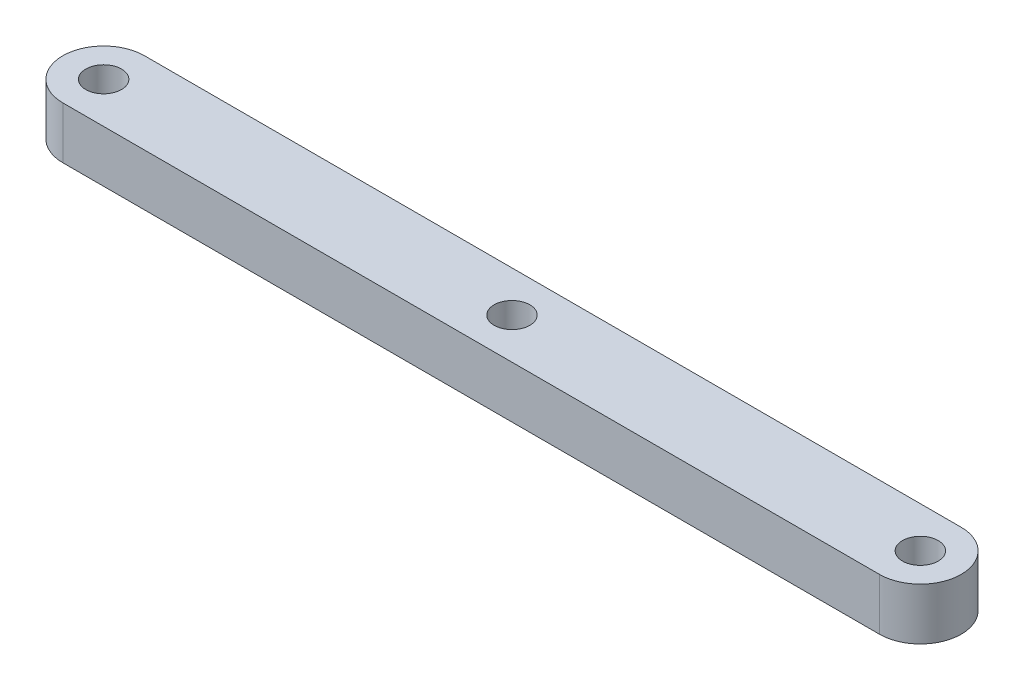
ISO-10303-21;
HEADER;
FILE_DESCRIPTION(('STEP AP214'),'2;1');
FILE_NAME('part.step','',(''),(''),'','','');
FILE_SCHEMA(('AUTOMOTIVE_DESIGN { 1 0 10303 214 1 1 1 1 }'));
ENDSEC;
DATA;
#1=APPLICATION_CONTEXT('core data for automotive mechanical design processes');
#2=APPLICATION_PROTOCOL_DEFINITION('international standard','automotive_design',2000,#1);
#3=PRODUCT_CONTEXT('',#1,'mechanical');
#4=PRODUCT('Part','Part','',(#3));
#5=PRODUCT_RELATED_PRODUCT_CATEGORY('part','',(#4));
#6=PRODUCT_DEFINITION_FORMATION('','',#4);
#7=PRODUCT_DEFINITION_CONTEXT('part definition',#1,'design');
#8=PRODUCT_DEFINITION('design','',#6,#7);
#9=PRODUCT_DEFINITION_SHAPE('','',#8);
#10=(LENGTH_UNIT() NAMED_UNIT(*) SI_UNIT(.MILLI.,.METRE.));
#11=(NAMED_UNIT(*) PLANE_ANGLE_UNIT() SI_UNIT($,.RADIAN.));
#12=(NAMED_UNIT(*) SI_UNIT($,.STERADIAN.) SOLID_ANGLE_UNIT());
#13=UNCERTAINTY_MEASURE_WITH_UNIT(LENGTH_MEASURE(1.E-05),#10,'distance_accuracy_value','');
#14=(GEOMETRIC_REPRESENTATION_CONTEXT(3) GLOBAL_UNCERTAINTY_ASSIGNED_CONTEXT((#13)) GLOBAL_UNIT_ASSIGNED_CONTEXT((#10,
#11,#12)) REPRESENTATION_CONTEXT('',''));
#15=CARTESIAN_POINT('',(0.,0.,0.));
#16=DIRECTION('',(0.,0.,1.));
#17=DIRECTION('',(1.,0.,0.));
#18=AXIS2_PLACEMENT_3D('',#15,#16,#17);
#19=CARTESIAN_POINT('',(-10.0217864923747,3.175,-4.02414143726367));
#20=DIRECTION('',(0.,1.,0.));
#21=DIRECTION('',(0.,0.,1.));
#22=AXIS2_PLACEMENT_3D('',#19,#20,#21);
#23=PLANE('',#22);
#24=CARTESIAN_POINT('',(39.9782135076253,3.175,-4.02414143726367));
#25=DIRECTION('',(0.,1.,0.));
#26=DIRECTION('',(0.,0.,1.));
#27=AXIS2_PLACEMENT_3D('',#24,#25,#26);
#28=CIRCLE('',#27,1.0922);
#29=CARTESIAN_POINT('',(39.9782135076253,3.175,-2.93194143726367));
#30=VERTEX_POINT('',#29);
#31=EDGE_CURVE('E115',#30,#30,#28,.T.);
#32=ORIENTED_EDGE('',*,*,#31,.F.);
#33=EDGE_LOOP('',(#32));
#34=FACE_BOUND('',#33,.T.);
#35=CARTESIAN_POINT('',(-10.0217864923747,3.175,-4.02414143726367));
#36=DIRECTION('',(0.,1.,0.));
#37=DIRECTION('',(0.,0.,1.));
#38=AXIS2_PLACEMENT_3D('',#35,#36,#37);
#39=CIRCLE('',#38,2.5);
#40=CARTESIAN_POINT('',(-10.0217864923747,3.175,-6.52414143726367));
#41=VERTEX_POINT('',#40);
#42=CARTESIAN_POINT('',(-10.0217864923747,3.175,-1.52414143726367));
#43=VERTEX_POINT('',#42);
#44=EDGE_CURVE('E85',#41,#43,#39,.T.);
#45=ORIENTED_EDGE('',*,*,#44,.T.);
#46=DIRECTION('',(1.,0.,0.));
#47=VECTOR('',#46,1.);
#48=CARTESIAN_POINT('',(-10.0217864923747,3.175,-1.52414143726367));
#49=LINE('',#48,#47);
#50=CARTESIAN_POINT('',(39.9782135076253,3.175,-1.52414143726367));
#51=VERTEX_POINT('',#50);
#52=EDGE_CURVE('E80',#43,#51,#49,.T.);
#53=ORIENTED_EDGE('',*,*,#52,.T.);
#54=CARTESIAN_POINT('',(39.9782135076253,3.175,-4.02414143726367));
#55=DIRECTION('',(0.,1.,0.));
#56=DIRECTION('',(0.,0.,1.));
#57=AXIS2_PLACEMENT_3D('',#54,#55,#56);
#58=CIRCLE('',#57,2.5);
#59=CARTESIAN_POINT('',(39.9782135076253,3.175,-6.52414143726367));
#60=VERTEX_POINT('',#59);
#61=EDGE_CURVE('E83',#51,#60,#58,.T.);
#62=ORIENTED_EDGE('',*,*,#61,.T.);
#63=DIRECTION('',(-1.,0.,0.));
#64=VECTOR('',#63,1.);
#65=CARTESIAN_POINT('',(-10.0217864923747,3.175,-6.52414143726367));
#66=LINE('',#65,#64);
#67=EDGE_CURVE('E50',#60,#41,#66,.T.);
#68=ORIENTED_EDGE('',*,*,#67,.T.);
#69=EDGE_LOOP('',(#45,#53,#62,#68));
#70=FACE_BOUND('',#69,.T.);
#71=CARTESIAN_POINT('',(-10.0217864923747,3.175,-4.02414143726367));
#72=DIRECTION('',(0.,1.,0.));
#73=DIRECTION('',(0.,0.,1.));
#74=AXIS2_PLACEMENT_3D('',#71,#72,#73);
#75=CIRCLE('',#74,1.0922);
#76=CARTESIAN_POINT('',(-10.0217864923747,3.175,-2.93194143726367));
#77=VERTEX_POINT('',#76);
#78=EDGE_CURVE('E100',#77,#77,#75,.T.);
#79=ORIENTED_EDGE('',*,*,#78,.F.);
#80=EDGE_LOOP('',(#79));
#81=FACE_BOUND('',#80,.T.);
#82=CARTESIAN_POINT('',(14.9782135076253,3.175,-4.02414143726367));
#83=DIRECTION('',(0.,1.,0.));
#84=DIRECTION('',(0.,0.,1.));
#85=AXIS2_PLACEMENT_3D('',#82,#83,#84);
#86=CIRCLE('',#85,1.0922);
#87=CARTESIAN_POINT('',(14.9782135076253,3.175,-2.93194143726367));
#88=VERTEX_POINT('',#87);
#89=EDGE_CURVE('E121',#88,#88,#86,.T.);
#90=ORIENTED_EDGE('',*,*,#89,.F.);
#91=EDGE_LOOP('',(#90));
#92=FACE_BOUND('',#91,.T.);
#93=ADVANCED_FACE('F33',(#34,#70,#81,#92),#23,.T.);
#94=CARTESIAN_POINT('',(-10.0217864923747,0.,-4.02414143726367));
#95=DIRECTION('',(0.,1.,0.));
#96=DIRECTION('',(0.,0.,1.));
#97=AXIS2_PLACEMENT_3D('',#94,#95,#96);
#98=PLANE('',#97);
#99=CARTESIAN_POINT('',(39.9782135076253,0.,-4.02414143726367));
#100=DIRECTION('',(0.,1.,0.));
#101=DIRECTION('',(0.,0.,1.));
#102=AXIS2_PLACEMENT_3D('',#99,#100,#101);
#103=CIRCLE('',#102,1.0922);
#104=CARTESIAN_POINT('',(39.9782135076253,0.,-2.93194143726367));
#105=VERTEX_POINT('',#104);
#106=EDGE_CURVE('E118',#105,#105,#103,.T.);
#107=ORIENTED_EDGE('',*,*,#106,.T.);
#108=EDGE_LOOP('',(#107));
#109=FACE_BOUND('',#108,.T.);
#110=CARTESIAN_POINT('',(-10.0217864923747,0.,-4.02414143726367));
#111=DIRECTION('',(0.,1.,0.));
#112=DIRECTION('',(0.,0.,1.));
#113=AXIS2_PLACEMENT_3D('',#110,#111,#112);
#114=CIRCLE('',#113,2.5);
#115=CARTESIAN_POINT('',(-10.0217864923747,0.,-6.52414143726367));
#116=VERTEX_POINT('',#115);
#117=CARTESIAN_POINT('',(-10.0217864923747,0.,-1.52414143726367));
#118=VERTEX_POINT('',#117);
#119=EDGE_CURVE('E97',#116,#118,#114,.T.);
#120=ORIENTED_EDGE('',*,*,#119,.F.);
#121=DIRECTION('',(-1.,0.,0.));
#122=VECTOR('',#121,1.);
#123=CARTESIAN_POINT('',(-10.0217864923747,0.,-6.52414143726367));
#124=LINE('',#123,#122);
#125=CARTESIAN_POINT('',(39.9782135076253,0.,-6.52414143726367));
#126=VERTEX_POINT('',#125);
#127=EDGE_CURVE('E73',#126,#116,#124,.T.);
#128=ORIENTED_EDGE('',*,*,#127,.F.);
#129=CARTESIAN_POINT('',(39.9782135076253,0.,-4.02414143726367));
#130=DIRECTION('',(0.,1.,0.));
#131=DIRECTION('',(0.,0.,1.));
#132=AXIS2_PLACEMENT_3D('',#129,#130,#131);
#133=CIRCLE('',#132,2.5);
#134=CARTESIAN_POINT('',(39.9782135076253,0.,-1.52414143726367));
#135=VERTEX_POINT('',#134);
#136=EDGE_CURVE('E67',#135,#126,#133,.T.);
#137=ORIENTED_EDGE('',*,*,#136,.F.);
#138=DIRECTION('',(1.,0.,0.));
#139=VECTOR('',#138,1.);
#140=CARTESIAN_POINT('',(-10.0217864923747,0.,-1.52414143726367));
#141=LINE('',#140,#139);
#142=EDGE_CURVE('E89',#118,#135,#141,.T.);
#143=ORIENTED_EDGE('',*,*,#142,.F.);
#144=EDGE_LOOP('',(#120,#128,#137,#143));
#145=FACE_BOUND('',#144,.T.);
#146=CARTESIAN_POINT('',(-10.0217864923747,0.,-4.02414143726367));
#147=DIRECTION('',(0.,1.,0.));
#148=DIRECTION('',(0.,0.,1.));
#149=AXIS2_PLACEMENT_3D('',#146,#147,#148);
#150=CIRCLE('',#149,1.0922);
#151=CARTESIAN_POINT('',(-10.0217864923747,0.,-2.93194143726367));
#152=VERTEX_POINT('',#151);
#153=EDGE_CURVE('E112',#152,#152,#150,.T.);
#154=ORIENTED_EDGE('',*,*,#153,.T.);
#155=EDGE_LOOP('',(#154));
#156=FACE_BOUND('',#155,.T.);
#157=CARTESIAN_POINT('',(14.9782135076253,0.,-4.02414143726367));
#158=DIRECTION('',(0.,1.,0.));
#159=DIRECTION('',(0.,0.,1.));
#160=AXIS2_PLACEMENT_3D('',#157,#158,#159);
#161=CIRCLE('',#160,1.0922);
#162=CARTESIAN_POINT('',(14.9782135076253,0.,-2.93194143726367));
#163=VERTEX_POINT('',#162);
#164=EDGE_CURVE('E124',#163,#163,#161,.T.);
#165=ORIENTED_EDGE('',*,*,#164,.T.);
#166=EDGE_LOOP('',(#165));
#167=FACE_BOUND('',#166,.T.);
#168=ADVANCED_FACE('F108',(#109,#145,#156,#167),#98,.F.);
#169=CARTESIAN_POINT('',(-10.0217864923747,3.175,-4.02414143726367));
#170=DIRECTION('',(0.,-1.,0.));
#171=DIRECTION('',(0.,0.,-1.));
#172=AXIS2_PLACEMENT_3D('',#169,#170,#171);
#173=CYLINDRICAL_SURFACE('',#172,2.5);
#174=ORIENTED_EDGE('',*,*,#119,.T.);
#175=DIRECTION('',(0.,-1.,0.));
#176=VECTOR('',#175,1.);
#177=CARTESIAN_POINT('',(-10.0217864923747,3.175,-1.52414143726367));
#178=LINE('',#177,#176);
#179=EDGE_CURVE('E11',#43,#118,#178,.T.);
#180=ORIENTED_EDGE('',*,*,#179,.F.);
#181=ORIENTED_EDGE('',*,*,#44,.F.);
#182=DIRECTION('',(0.,-1.,0.));
#183=VECTOR('',#182,1.);
#184=CARTESIAN_POINT('',(-10.0217864923747,3.175,-6.52414143726367));
#185=LINE('',#184,#183);
#186=EDGE_CURVE('E93',#41,#116,#185,.T.);
#187=ORIENTED_EDGE('',*,*,#186,.T.);
#188=EDGE_LOOP('',(#174,#180,#181,#187));
#189=FACE_BOUND('',#188,.T.);
#190=ADVANCED_FACE('F35',(#189),#173,.T.);
#191=CARTESIAN_POINT('',(-10.0217864923747,3.175,-1.52414143726367));
#192=DIRECTION('',(0.,0.,-1.));
#193=DIRECTION('',(-1.,0.,0.));
#194=AXIS2_PLACEMENT_3D('',#191,#192,#193);
#195=PLANE('',#194);
#196=ORIENTED_EDGE('',*,*,#142,.T.);
#197=DIRECTION('',(0.,-1.,0.));
#198=VECTOR('',#197,1.);
#199=CARTESIAN_POINT('',(39.9782135076253,3.175,-1.52414143726367));
#200=LINE('',#199,#198);
#201=EDGE_CURVE('E42',#51,#135,#200,.T.);
#202=ORIENTED_EDGE('',*,*,#201,.F.);
#203=ORIENTED_EDGE('',*,*,#52,.F.);
#204=ORIENTED_EDGE('',*,*,#179,.T.);
#205=EDGE_LOOP('',(#196,#202,#203,#204));
#206=FACE_BOUND('',#205,.T.);
#207=ADVANCED_FACE('F88',(#206),#195,.F.);
#208=CARTESIAN_POINT('',(39.9782135076253,3.175,-4.02414143726367));
#209=DIRECTION('',(0.,-1.,0.));
#210=DIRECTION('',(0.,0.,-1.));
#211=AXIS2_PLACEMENT_3D('',#208,#209,#210);
#212=CYLINDRICAL_SURFACE('',#211,2.5);
#213=ORIENTED_EDGE('',*,*,#136,.T.);
#214=DIRECTION('',(0.,-1.,0.));
#215=VECTOR('',#214,1.);
#216=CARTESIAN_POINT('',(39.9782135076253,3.175,-6.52414143726367));
#217=LINE('',#216,#215);
#218=EDGE_CURVE('E90',#60,#126,#217,.T.);
#219=ORIENTED_EDGE('',*,*,#218,.F.);
#220=ORIENTED_EDGE('',*,*,#61,.F.);
#221=ORIENTED_EDGE('',*,*,#201,.T.);
#222=EDGE_LOOP('',(#213,#219,#220,#221));
#223=FACE_BOUND('',#222,.T.);
#224=ADVANCED_FACE('F91',(#223),#212,.T.);
#225=CARTESIAN_POINT('',(-10.0217864923747,3.175,-6.52414143726367));
#226=DIRECTION('',(0.,0.,1.));
#227=DIRECTION('',(1.,0.,0.));
#228=AXIS2_PLACEMENT_3D('',#225,#226,#227);
#229=PLANE('',#228);
#230=ORIENTED_EDGE('',*,*,#127,.T.);
#231=ORIENTED_EDGE('',*,*,#186,.F.);
#232=ORIENTED_EDGE('',*,*,#67,.F.);
#233=ORIENTED_EDGE('',*,*,#218,.T.);
#234=EDGE_LOOP('',(#230,#231,#232,#233));
#235=FACE_BOUND('',#234,.T.);
#236=ADVANCED_FACE('F105',(#235),#229,.F.);
#237=CARTESIAN_POINT('',(-10.0217864923747,3.175,-4.02414143726367));
#238=DIRECTION('',(0.,-1.,0.));
#239=DIRECTION('',(0.,0.,-1.));
#240=AXIS2_PLACEMENT_3D('',#237,#238,#239);
#241=CYLINDRICAL_SURFACE('',#240,1.0922);
#242=ORIENTED_EDGE('',*,*,#78,.T.);
#243=EDGE_LOOP('',(#242));
#244=FACE_BOUND('',#243,.T.);
#245=ORIENTED_EDGE('',*,*,#153,.F.);
#246=EDGE_LOOP('',(#245));
#247=FACE_BOUND('',#246,.T.);
#248=ADVANCED_FACE('F143',(#244,#247),#241,.F.);
#249=CARTESIAN_POINT('',(39.9782135076253,3.175,-4.02414143726367));
#250=DIRECTION('',(0.,-1.,0.));
#251=DIRECTION('',(0.,0.,-1.));
#252=AXIS2_PLACEMENT_3D('',#249,#250,#251);
#253=CYLINDRICAL_SURFACE('',#252,1.0922);
#254=ORIENTED_EDGE('',*,*,#31,.T.);
#255=EDGE_LOOP('',(#254));
#256=FACE_BOUND('',#255,.T.);
#257=ORIENTED_EDGE('',*,*,#106,.F.);
#258=EDGE_LOOP('',(#257));
#259=FACE_BOUND('',#258,.T.);
#260=ADVANCED_FACE('F189',(#256,#259),#253,.F.);
#261=CARTESIAN_POINT('',(14.9782135076253,3.175,-4.02414143726367));
#262=DIRECTION('',(0.,-1.,0.));
#263=DIRECTION('',(0.,0.,-1.));
#264=AXIS2_PLACEMENT_3D('',#261,#262,#263);
#265=CYLINDRICAL_SURFACE('',#264,1.0922);
#266=ORIENTED_EDGE('',*,*,#89,.T.);
#267=EDGE_LOOP('',(#266));
#268=FACE_BOUND('',#267,.T.);
#269=ORIENTED_EDGE('',*,*,#164,.F.);
#270=EDGE_LOOP('',(#269));
#271=FACE_BOUND('',#270,.T.);
#272=ADVANCED_FACE('F130',(#268,#271),#265,.F.);
#273=CLOSED_SHELL('',(#93,#168,#190,#207,#224,#236,#248,#260,#272));
#274=MANIFOLD_SOLID_BREP('B2',#273);
#275=ADVANCED_BREP_SHAPE_REPRESENTATION('',(#18,#274),#14);
#276=SHAPE_DEFINITION_REPRESENTATION(#9,#275);
ENDSEC;
END-ISO-10303-21;
